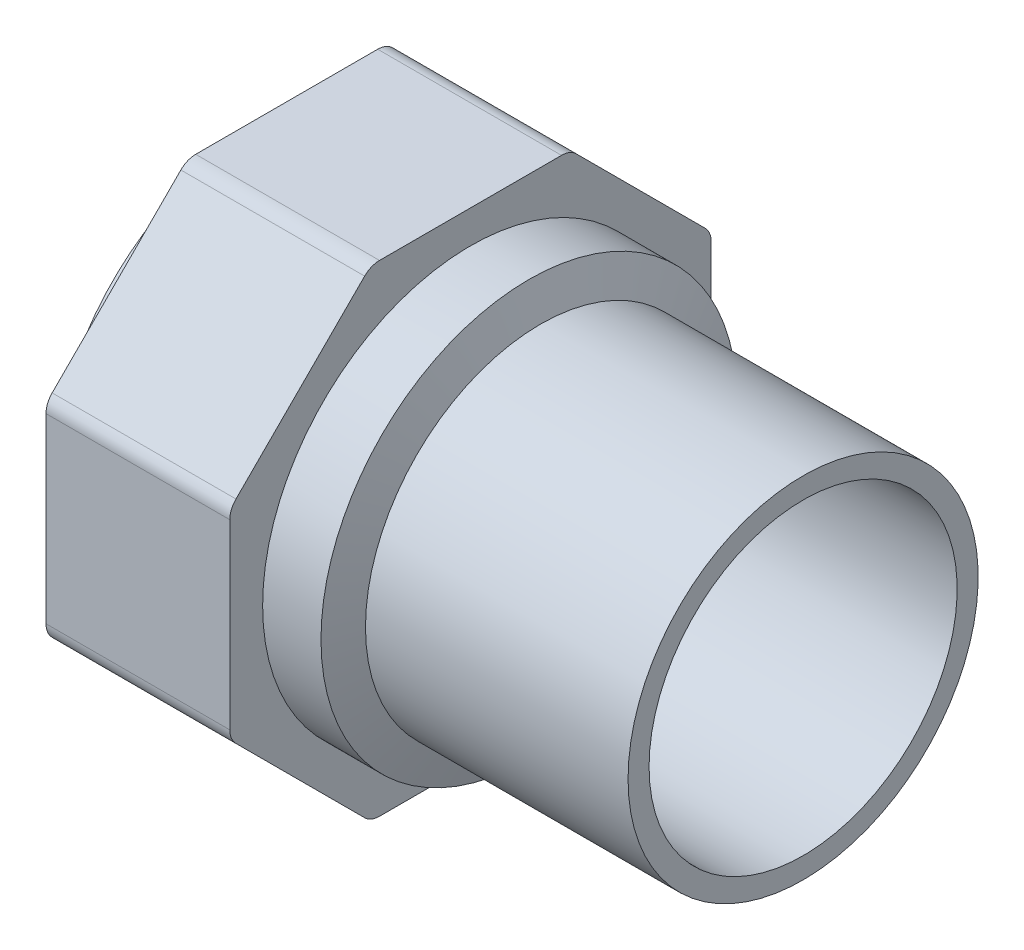
ISO-10303-21;
HEADER;
FILE_DESCRIPTION(('STEP AP214'),'2;1');
FILE_NAME('part.step','',(''),(''),'','','');
FILE_SCHEMA(('AUTOMOTIVE_DESIGN { 1 0 10303 214 1 1 1 1 }'));
ENDSEC;
DATA;
#1=APPLICATION_CONTEXT('core data for automotive mechanical design processes');
#2=APPLICATION_PROTOCOL_DEFINITION('international standard','automotive_design',2000,#1);
#3=PRODUCT_CONTEXT('',#1,'mechanical');
#4=PRODUCT('Part','Part','',(#3));
#5=PRODUCT_RELATED_PRODUCT_CATEGORY('part','',(#4));
#6=PRODUCT_DEFINITION_FORMATION('','',#4);
#7=PRODUCT_DEFINITION_CONTEXT('part definition',#1,'design');
#8=PRODUCT_DEFINITION('design','',#6,#7);
#9=PRODUCT_DEFINITION_SHAPE('','',#8);
#10=(LENGTH_UNIT() NAMED_UNIT(*) SI_UNIT(.MILLI.,.METRE.));
#11=(NAMED_UNIT(*) PLANE_ANGLE_UNIT() SI_UNIT($,.RADIAN.));
#12=(NAMED_UNIT(*) SI_UNIT($,.STERADIAN.) SOLID_ANGLE_UNIT());
#13=UNCERTAINTY_MEASURE_WITH_UNIT(LENGTH_MEASURE(1.E-05),#10,'distance_accuracy_value','');
#14=(GEOMETRIC_REPRESENTATION_CONTEXT(3) GLOBAL_UNCERTAINTY_ASSIGNED_CONTEXT((#13)) GLOBAL_UNIT_ASSIGNED_CONTEXT((#10,
#11,#12)) REPRESENTATION_CONTEXT('',''));
#15=CARTESIAN_POINT('',(0.,0.,0.));
#16=DIRECTION('',(0.,0.,1.));
#17=DIRECTION('',(1.,0.,0.));
#18=AXIS2_PLACEMENT_3D('',#15,#16,#17);
#19=CARTESIAN_POINT('',(-30.,0.,0.));
#20=DIRECTION('',(-1.,0.,0.));
#21=DIRECTION('',(0.,0.,1.));
#22=AXIS2_PLACEMENT_3D('',#19,#20,#21);
#23=CYLINDRICAL_SURFACE('',#22,20.);
#24=CARTESIAN_POINT('',(-30.,0.,0.));
#25=DIRECTION('',(1.,0.,0.));
#26=DIRECTION('',(0.,1.,0.));
#27=AXIS2_PLACEMENT_3D('',#24,#25,#26);
#28=CIRCLE('',#27,20.);
#29=CARTESIAN_POINT('',(-30.,20.,0.));
#30=VERTEX_POINT('',#29);
#31=EDGE_CURVE('E193',#30,#30,#28,.F.);
#32=ORIENTED_EDGE('',*,*,#31,.F.);
#33=EDGE_LOOP('',(#32));
#34=FACE_BOUND('',#33,.T.);
#35=CARTESIAN_POINT('',(0.,0.,0.));
#36=DIRECTION('',(-1.,0.,0.));
#37=DIRECTION('',(0.,0.,1.));
#38=AXIS2_PLACEMENT_3D('',#35,#36,#37);
#39=CIRCLE('',#38,20.);
#40=CARTESIAN_POINT('',(0.,0.,20.));
#41=VERTEX_POINT('',#40);
#42=EDGE_CURVE('E18',#41,#41,#39,.F.);
#43=ORIENTED_EDGE('',*,*,#42,.F.);
#44=EDGE_LOOP('',(#43));
#45=FACE_BOUND('',#44,.T.);
#46=ADVANCED_FACE('F15',(#34,#45),#23,.T.);
#47=CARTESIAN_POINT('',(-30.,0.,0.));
#48=DIRECTION('',(-1.,0.,0.));
#49=DIRECTION('',(0.,0.,1.));
#50=AXIS2_PLACEMENT_3D('',#47,#48,#49);
#51=CONICAL_SURFACE('',#50,20.,1.22918083614709);
#52=CARTESIAN_POINT('',(-31.3333333333333,0.,0.));
#53=DIRECTION('',(-1.,0.,0.));
#54=DIRECTION('',(0.,1.,0.));
#55=AXIS2_PLACEMENT_3D('',#52,#53,#54);
#56=CIRCLE('',#55,23.75);
#57=CARTESIAN_POINT('',(-31.3333333333333,23.75,0.));
#58=VERTEX_POINT('',#57);
#59=EDGE_CURVE('E189',#58,#58,#56,.T.);
#60=ORIENTED_EDGE('',*,*,#59,.F.);
#61=EDGE_LOOP('',(#60));
#62=FACE_BOUND('',#61,.T.);
#63=ORIENTED_EDGE('',*,*,#31,.T.);
#64=EDGE_LOOP('',(#63));
#65=FACE_BOUND('',#64,.T.);
#66=ADVANCED_FACE('F268',(#62,#65),#51,.T.);
#67=CARTESIAN_POINT('',(0.,20.,20.2400021083974));
#68=DIRECTION('',(1.,0.,0.));
#69=DIRECTION('',(0.,-1.,0.));
#70=AXIS2_PLACEMENT_3D('',#67,#68,#69);
#71=PLANE('',#70);
#72=CARTESIAN_POINT('',(0.,0.,0.));
#73=DIRECTION('',(-1.,0.,0.));
#74=DIRECTION('',(0.,0.,1.));
#75=AXIS2_PLACEMENT_3D('',#72,#73,#74);
#76=CIRCLE('',#75,17.6);
#77=CARTESIAN_POINT('',(0.,0.,17.6));
#78=VERTEX_POINT('',#77);
#79=EDGE_CURVE('E192',#78,#78,#76,.F.);
#80=ORIENTED_EDGE('',*,*,#79,.F.);
#81=EDGE_LOOP('',(#80));
#82=FACE_BOUND('',#81,.T.);
#83=ORIENTED_EDGE('',*,*,#42,.T.);
#84=EDGE_LOOP('',(#83));
#85=FACE_BOUND('',#84,.T.);
#86=ADVANCED_FACE('F264',(#82,#85),#71,.T.);
#87=CARTESIAN_POINT('',(-38.,0.,0.));
#88=DIRECTION('',(-1.,0.,0.));
#89=DIRECTION('',(0.,0.,1.));
#90=AXIS2_PLACEMENT_3D('',#87,#88,#89);
#91=CYLINDRICAL_SURFACE('',#90,23.75);
#92=CARTESIAN_POINT('',(-38.,0.,0.));
#93=DIRECTION('',(-1.,0.,0.));
#94=DIRECTION('',(0.,0.,1.));
#95=AXIS2_PLACEMENT_3D('',#92,#93,#94);
#96=CIRCLE('',#95,23.75);
#97=CARTESIAN_POINT('',(-38.,0.,23.75));
#98=VERTEX_POINT('',#97);
#99=EDGE_CURVE('E188',#98,#98,#96,.T.);
#100=ORIENTED_EDGE('',*,*,#99,.F.);
#101=EDGE_LOOP('',(#100));
#102=FACE_BOUND('',#101,.T.);
#103=ORIENTED_EDGE('',*,*,#59,.T.);
#104=EDGE_LOOP('',(#103));
#105=FACE_BOUND('',#104,.T.);
#106=ADVANCED_FACE('F267',(#102,#105),#91,.T.);
#107=CARTESIAN_POINT('',(0.,0.,0.));
#108=DIRECTION('',(-1.,0.,0.));
#109=DIRECTION('',(0.,0.,1.));
#110=AXIS2_PLACEMENT_3D('',#107,#108,#109);
#111=CYLINDRICAL_SURFACE('',#110,17.6);
#112=ORIENTED_EDGE('',*,*,#79,.T.);
#113=EDGE_LOOP('',(#112));
#114=FACE_BOUND('',#113,.T.);
#115=CARTESIAN_POINT('',(-37.6326404910334,0.,0.));
#116=DIRECTION('',(1.,0.,0.));
#117=DIRECTION('',(0.,1.,0.));
#118=AXIS2_PLACEMENT_3D('',#115,#116,#117);
#119=CIRCLE('',#118,17.6);
#120=CARTESIAN_POINT('',(-37.6326404910334,17.6,0.));
#121=VERTEX_POINT('',#120);
#122=EDGE_CURVE('E135',#121,#121,#119,.T.);
#123=ORIENTED_EDGE('',*,*,#122,.F.);
#124=EDGE_LOOP('',(#123));
#125=FACE_BOUND('',#124,.T.);
#126=ADVANCED_FACE('F261',(#114,#125),#111,.F.);
#127=CARTESIAN_POINT('',(-38.,27.5,27.5));
#128=DIRECTION('',(1.,0.,0.));
#129=DIRECTION('',(0.,-1.,0.));
#130=AXIS2_PLACEMENT_3D('',#127,#128,#129);
#131=PLANE('',#130);
#132=ORIENTED_EDGE('',*,*,#99,.T.);
#133=EDGE_LOOP('',(#132));
#134=FACE_BOUND('',#133,.T.);
#135=CARTESIAN_POINT('',(-38.,10.3967604155647,25.1));
#136=DIRECTION('',(1.,0.,0.));
#137=DIRECTION('',(0.,0.,-1.));
#138=AXIS2_PLACEMENT_3D('',#135,#136,#137);
#139=CIRCLE('',#138,2.4);
#140=CARTESIAN_POINT('',(-38.,10.3967604155647,27.5));
#141=VERTEX_POINT('',#140);
#142=CARTESIAN_POINT('',(-38.,12.0938166904124,26.7970562748477));
#143=VERTEX_POINT('',#142);
#144=EDGE_CURVE('E254',#141,#143,#139,.F.);
#145=ORIENTED_EDGE('',*,*,#144,.F.);
#146=DIRECTION('',(0.,1.,0.));
#147=VECTOR('',#146,1.);
#148=CARTESIAN_POINT('',(-38.,0.,27.5));
#149=LINE('',#148,#147);
#150=CARTESIAN_POINT('',(-38.,-10.3967604155647,27.5));
#151=VERTEX_POINT('',#150);
#152=EDGE_CURVE('E132',#151,#141,#149,.T.);
#153=ORIENTED_EDGE('',*,*,#152,.F.);
#154=CARTESIAN_POINT('',(-38.,-10.3967604155647,25.1));
#155=DIRECTION('',(1.,0.,0.));
#156=DIRECTION('',(0.,0.,-1.));
#157=AXIS2_PLACEMENT_3D('',#154,#155,#156);
#158=CIRCLE('',#157,2.39999999999996);
#159=CARTESIAN_POINT('',(-38.,-12.0938166904124,26.7970562748477));
#160=VERTEX_POINT('',#159);
#161=EDGE_CURVE('E126',#160,#151,#158,.F.);
#162=ORIENTED_EDGE('',*,*,#161,.F.);
#163=DIRECTION('',(0.,0.707106781186547,0.707106781186548));
#164=VECTOR('',#163,1.);
#165=CARTESIAN_POINT('',(-38.,-19.4454364826301,19.44543648263));
#166=LINE('',#165,#164);
#167=CARTESIAN_POINT('',(-38.,-26.7970562748477,12.0938166904124));
#168=VERTEX_POINT('',#167);
#169=EDGE_CURVE('E130',#168,#160,#166,.T.);
#170=ORIENTED_EDGE('',*,*,#169,.F.);
#171=CARTESIAN_POINT('',(-38.,-25.1,10.3967604155647));
#172=DIRECTION('',(1.,0.,0.));
#173=DIRECTION('',(0.,0.,-1.));
#174=AXIS2_PLACEMENT_3D('',#171,#172,#173);
#175=CIRCLE('',#174,2.39999999999998);
#176=CARTESIAN_POINT('',(-38.,-27.5,10.3967604155647));
#177=VERTEX_POINT('',#176);
#178=EDGE_CURVE('E149',#177,#168,#175,.F.);
#179=ORIENTED_EDGE('',*,*,#178,.F.);
#180=DIRECTION('',(0.,0.,1.));
#181=VECTOR('',#180,1.);
#182=CARTESIAN_POINT('',(-38.,-27.5,0.));
#183=LINE('',#182,#181);
#184=CARTESIAN_POINT('',(-38.,-27.5,-10.3967604155647));
#185=VERTEX_POINT('',#184);
#186=EDGE_CURVE('E154',#185,#177,#183,.T.);
#187=ORIENTED_EDGE('',*,*,#186,.F.);
#188=CARTESIAN_POINT('',(-38.,-25.1,-10.3967604155647));
#189=DIRECTION('',(1.,0.,0.));
#190=DIRECTION('',(0.,0.,-1.));
#191=AXIS2_PLACEMENT_3D('',#188,#189,#190);
#192=CIRCLE('',#191,2.39999999999995);
#193=CARTESIAN_POINT('',(-38.,-26.7970562748477,-12.0938166904124));
#194=VERTEX_POINT('',#193);
#195=EDGE_CURVE('E239',#194,#185,#192,.F.);
#196=ORIENTED_EDGE('',*,*,#195,.F.);
#197=DIRECTION('',(0.,-0.707106781186548,0.707106781186547));
#198=VECTOR('',#197,1.);
#199=CARTESIAN_POINT('',(-38.,-19.44543648263,-19.4454364826301));
#200=LINE('',#199,#198);
#201=CARTESIAN_POINT('',(-38.,-12.0938166904124,-26.7970562748477));
#202=VERTEX_POINT('',#201);
#203=EDGE_CURVE('E159',#202,#194,#200,.T.);
#204=ORIENTED_EDGE('',*,*,#203,.F.);
#205=CARTESIAN_POINT('',(-38.,-10.3967604155647,-25.1));
#206=DIRECTION('',(1.,0.,0.));
#207=DIRECTION('',(0.,0.,-1.));
#208=AXIS2_PLACEMENT_3D('',#205,#206,#207);
#209=CIRCLE('',#208,2.39999999999997);
#210=CARTESIAN_POINT('',(-38.,-10.3967604155647,-27.5));
#211=VERTEX_POINT('',#210);
#212=EDGE_CURVE('E242',#211,#202,#209,.F.);
#213=ORIENTED_EDGE('',*,*,#212,.F.);
#214=DIRECTION('',(0.,-1.,0.));
#215=VECTOR('',#214,1.);
#216=CARTESIAN_POINT('',(-38.,0.,-27.5));
#217=LINE('',#216,#215);
#218=CARTESIAN_POINT('',(-38.,10.3967604155647,-27.5));
#219=VERTEX_POINT('',#218);
#220=EDGE_CURVE('E164',#219,#211,#217,.T.);
#221=ORIENTED_EDGE('',*,*,#220,.F.);
#222=CARTESIAN_POINT('',(-38.,10.3967604155647,-25.1));
#223=DIRECTION('',(1.,0.,0.));
#224=DIRECTION('',(0.,0.,-1.));
#225=AXIS2_PLACEMENT_3D('',#222,#223,#224);
#226=CIRCLE('',#225,2.39999999999999);
#227=CARTESIAN_POINT('',(-38.,12.0938166904124,-26.7970562748477));
#228=VERTEX_POINT('',#227);
#229=EDGE_CURVE('E245',#228,#219,#226,.F.);
#230=ORIENTED_EDGE('',*,*,#229,.F.);
#231=DIRECTION('',(0.,-0.707106781186548,-0.707106781186547));
#232=VECTOR('',#231,1.);
#233=CARTESIAN_POINT('',(-38.,19.4454364826301,-19.4454364826301));
#234=LINE('',#233,#232);
#235=CARTESIAN_POINT('',(-38.,26.7970562748477,-12.0938166904124));
#236=VERTEX_POINT('',#235);
#237=EDGE_CURVE('E169',#236,#228,#234,.T.);
#238=ORIENTED_EDGE('',*,*,#237,.F.);
#239=CARTESIAN_POINT('',(-38.,25.1,-10.3967604155647));
#240=DIRECTION('',(1.,0.,0.));
#241=DIRECTION('',(0.,0.,-1.));
#242=AXIS2_PLACEMENT_3D('',#239,#240,#241);
#243=CIRCLE('',#242,2.39999999999999);
#244=CARTESIAN_POINT('',(-38.,27.5,-10.3967604155647));
#245=VERTEX_POINT('',#244);
#246=EDGE_CURVE('E248',#245,#236,#243,.F.);
#247=ORIENTED_EDGE('',*,*,#246,.F.);
#248=DIRECTION('',(0.,0.,-1.));
#249=VECTOR('',#248,1.);
#250=CARTESIAN_POINT('',(-38.,27.5,0.));
#251=LINE('',#250,#249);
#252=CARTESIAN_POINT('',(-38.,27.5,10.3967604155647));
#253=VERTEX_POINT('',#252);
#254=EDGE_CURVE('E174',#253,#245,#251,.T.);
#255=ORIENTED_EDGE('',*,*,#254,.F.);
#256=CARTESIAN_POINT('',(-38.,25.1,10.3967604155647));
#257=DIRECTION('',(1.,0.,0.));
#258=DIRECTION('',(0.,0.,-1.));
#259=AXIS2_PLACEMENT_3D('',#256,#257,#258);
#260=CIRCLE('',#259,2.39999999999998);
#261=CARTESIAN_POINT('',(-38.,26.7970562748477,12.0938166904124));
#262=VERTEX_POINT('',#261);
#263=EDGE_CURVE('E251',#262,#253,#260,.F.);
#264=ORIENTED_EDGE('',*,*,#263,.F.);
#265=DIRECTION('',(0.,0.707106781186548,-0.707106781186548));
#266=VECTOR('',#265,1.);
#267=CARTESIAN_POINT('',(-38.,19.4454364826301,19.4454364826301));
#268=LINE('',#267,#266);
#269=EDGE_CURVE('E179',#143,#262,#268,.T.);
#270=ORIENTED_EDGE('',*,*,#269,.F.);
#271=EDGE_LOOP('',(#145,#153,#162,#170,#179,#187,#196,#204,#213,#221,#230,#238,#247,#255,#264,#270));
#272=FACE_BOUND('',#271,.T.);
#273=ADVANCED_FACE('F128',(#134,#272),#131,.T.);
#274=CARTESIAN_POINT('',(-38.,0.,0.));
#275=DIRECTION('',(-1.,0.,0.));
#276=DIRECTION('',(0.,0.,1.));
#277=AXIS2_PLACEMENT_3D('',#274,#275,#276);
#278=CONICAL_SURFACE('',#277,18.2362853341737,1.04719755119659);
#279=ORIENTED_EDGE('',*,*,#122,.T.);
#280=EDGE_LOOP('',(#279));
#281=FACE_BOUND('',#280,.T.);
#282=CARTESIAN_POINT('',(-38.,0.,0.));
#283=DIRECTION('',(1.,0.,0.));
#284=DIRECTION('',(0.,1.,0.));
#285=AXIS2_PLACEMENT_3D('',#282,#283,#284);
#286=CIRCLE('',#285,18.2362853341737);
#287=CARTESIAN_POINT('',(-38.,18.2362853341737,0.));
#288=VERTEX_POINT('',#287);
#289=EDGE_CURVE('E153',#288,#288,#286,.T.);
#290=ORIENTED_EDGE('',*,*,#289,.F.);
#291=EDGE_LOOP('',(#290));
#292=FACE_BOUND('',#291,.T.);
#293=ADVANCED_FACE('F438',(#281,#292),#278,.F.);
#294=CARTESIAN_POINT('',(-38.,-10.3967604155647,25.1));
#295=DIRECTION('',(1.,0.,0.));
#296=DIRECTION('',(0.,0.,-1.));
#297=AXIS2_PLACEMENT_3D('',#294,#295,#296);
#298=CYLINDRICAL_SURFACE('',#297,2.39999999999996);
#299=CARTESIAN_POINT('',(-59.,-10.3967604155647,25.1));
#300=DIRECTION('',(1.,0.,0.));
#301=DIRECTION('',(0.,0.,-1.));
#302=AXIS2_PLACEMENT_3D('',#299,#300,#301);
#303=CIRCLE('',#302,2.39999999999996);
#304=CARTESIAN_POINT('',(-59.,-12.0938166904124,26.7970562748477));
#305=VERTEX_POINT('',#304);
#306=CARTESIAN_POINT('',(-59.,-10.3967604155647,27.5));
#307=VERTEX_POINT('',#306);
#308=EDGE_CURVE('E141',#305,#307,#303,.F.);
#309=ORIENTED_EDGE('',*,*,#308,.F.);
#310=DIRECTION('',(1.,0.,0.));
#311=VECTOR('',#310,1.);
#312=CARTESIAN_POINT('',(-59.,-12.0938166904124,26.7970562748477));
#313=LINE('',#312,#311);
#314=EDGE_CURVE('E138',#160,#305,#313,.F.);
#315=ORIENTED_EDGE('',*,*,#314,.F.);
#316=ORIENTED_EDGE('',*,*,#161,.T.);
#317=DIRECTION('',(1.,0.,0.));
#318=VECTOR('',#317,1.);
#319=CARTESIAN_POINT('',(-59.,-10.3967604155647,27.5));
#320=LINE('',#319,#318);
#321=EDGE_CURVE('E185',#307,#151,#320,.T.);
#322=ORIENTED_EDGE('',*,*,#321,.F.);
#323=EDGE_LOOP('',(#309,#315,#316,#322));
#324=FACE_BOUND('',#323,.T.);
#325=ADVANCED_FACE('F139',(#324),#298,.T.);
#326=CARTESIAN_POINT('',(-59.,10.3967604155647,27.5));
#327=DIRECTION('',(0.,0.,1.));
#328=DIRECTION('',(0.,-1.,0.));
#329=AXIS2_PLACEMENT_3D('',#326,#327,#328);
#330=PLANE('',#329);
#331=DIRECTION('',(0.,1.,0.));
#332=VECTOR('',#331,1.);
#333=CARTESIAN_POINT('',(-59.,0.,27.5));
#334=LINE('',#333,#332);
#335=CARTESIAN_POINT('',(-59.,10.3967604155647,27.5));
#336=VERTEX_POINT('',#335);
#337=EDGE_CURVE('E236',#307,#336,#334,.T.);
#338=ORIENTED_EDGE('',*,*,#337,.F.);
#339=ORIENTED_EDGE('',*,*,#321,.T.);
#340=ORIENTED_EDGE('',*,*,#152,.T.);
#341=DIRECTION('',(1.,0.,0.));
#342=VECTOR('',#341,1.);
#343=CARTESIAN_POINT('',(-48.5,10.3967604155647,27.5));
#344=LINE('',#343,#342);
#345=EDGE_CURVE('E183',#336,#141,#344,.T.);
#346=ORIENTED_EDGE('',*,*,#345,.F.);
#347=EDGE_LOOP('',(#338,#339,#340,#346));
#348=FACE_BOUND('',#347,.T.);
#349=ADVANCED_FACE('F387',(#348),#330,.T.);
#350=CARTESIAN_POINT('',(-38.,10.3967604155647,25.1));
#351=DIRECTION('',(1.,0.,0.));
#352=DIRECTION('',(0.,0.,-1.));
#353=AXIS2_PLACEMENT_3D('',#350,#351,#352);
#354=CYLINDRICAL_SURFACE('',#353,2.4);
#355=CARTESIAN_POINT('',(-59.,10.3967604155647,25.1));
#356=DIRECTION('',(1.,0.,0.));
#357=DIRECTION('',(0.,0.,-1.));
#358=AXIS2_PLACEMENT_3D('',#355,#356,#357);
#359=CIRCLE('',#358,2.4);
#360=CARTESIAN_POINT('',(-59.,12.0938166904124,26.7970562748477));
#361=VERTEX_POINT('',#360);
#362=EDGE_CURVE('E233',#336,#361,#359,.F.);
#363=ORIENTED_EDGE('',*,*,#362,.F.);
#364=ORIENTED_EDGE('',*,*,#345,.T.);
#365=ORIENTED_EDGE('',*,*,#144,.T.);
#366=DIRECTION('',(1.,0.,0.));
#367=VECTOR('',#366,1.);
#368=CARTESIAN_POINT('',(-59.,12.0938166904124,26.7970562748477));
#369=LINE('',#368,#367);
#370=EDGE_CURVE('E182',#361,#143,#369,.T.);
#371=ORIENTED_EDGE('',*,*,#370,.F.);
#372=EDGE_LOOP('',(#363,#364,#365,#371));
#373=FACE_BOUND('',#372,.T.);
#374=ADVANCED_FACE('F425',(#373),#354,.T.);
#375=CARTESIAN_POINT('',(-59.,26.7970562748477,12.0938166904124));
#376=DIRECTION('',(0.,0.707106781186547,0.707106781186547));
#377=DIRECTION('',(0.,-0.707106781186547,0.707106781186547));
#378=AXIS2_PLACEMENT_3D('',#375,#376,#377);
#379=PLANE('',#378);
#380=CARTESIAN_POINT('',(-59.,12.0938166904124,26.7970562748477));
#381=CARTESIAN_POINT('',(-59.,12.7064516730972,26.1844212921629));
#382=CARTESIAN_POINT('',(-59.,13.319086655782,25.5717863094781));
#383=CARTESIAN_POINT('',(-59.,14.5443566211516,24.3465163441085));
#384=CARTESIAN_POINT('',(-59.,15.1569916038364,23.7338813614237));
#385=CARTESIAN_POINT('',(-59.,16.382261569206,22.5086113960541));
#386=CARTESIAN_POINT('',(-59.,16.9948965518908,21.8959764133693));
#387=CARTESIAN_POINT('',(-59.,18.2201665172604,20.6707064479997));
#388=CARTESIAN_POINT('',(-59.,18.8328014999453,20.0580714653149));
#389=CARTESIAN_POINT('',(-59.,20.0580714653149,18.8328014999453));
#390=CARTESIAN_POINT('',(-59.,20.6707064479997,18.2201665172604));
#391=CARTESIAN_POINT('',(-59.,21.8959764133693,16.9948965518908));
#392=CARTESIAN_POINT('',(-59.,22.5086113960541,16.382261569206));
#393=CARTESIAN_POINT('',(-59.,23.7338813614237,15.1569916038364));
#394=CARTESIAN_POINT('',(-59.,24.3465163441085,14.5443566211516));
#395=CARTESIAN_POINT('',(-59.,25.5717863094781,13.319086655782));
#396=CARTESIAN_POINT('',(-59.,26.1844212921629,12.7064516730972));
#397=CARTESIAN_POINT('',(-59.,26.7970562748477,12.0938166904124));
#398=B_SPLINE_CURVE_WITH_KNOTS('',3,(#380,#381,#382,#383,#384,#385,#386,#387,#388,#389,#390,
#391,#392,#393,#394,#395,#396,#397),.UNSPECIFIED.,.F.,.F.,(4,2,2,2,2,2,2,2,4),(0.,
2.59919010389117,5.19838020778234,7.79757031167351,10.3967604155647,12.9959505194559,
15.595140623347,18.1943307272382,20.7935208311294),.UNSPECIFIED.);
#399=CARTESIAN_POINT('',(-59.,26.7970562748477,12.0938166904124));
#400=VERTEX_POINT('',#399);
#401=EDGE_CURVE('E232',#361,#400,#398,.T.);
#402=ORIENTED_EDGE('',*,*,#401,.F.);
#403=ORIENTED_EDGE('',*,*,#370,.T.);
#404=ORIENTED_EDGE('',*,*,#269,.T.);
#405=DIRECTION('',(1.,0.,0.));
#406=VECTOR('',#405,1.);
#407=CARTESIAN_POINT('',(-48.5,26.7970562748477,12.0938166904124));
#408=LINE('',#407,#406);
#409=EDGE_CURVE('E178',#400,#262,#408,.T.);
#410=ORIENTED_EDGE('',*,*,#409,.F.);
#411=EDGE_LOOP('',(#402,#403,#404,#410));
#412=FACE_BOUND('',#411,.T.);
#413=ADVANCED_FACE('F423',(#412),#379,.T.);
#414=CARTESIAN_POINT('',(-38.,25.1,10.3967604155647));
#415=DIRECTION('',(1.,0.,0.));
#416=DIRECTION('',(0.,0.,-1.));
#417=AXIS2_PLACEMENT_3D('',#414,#415,#416);
#418=CYLINDRICAL_SURFACE('',#417,2.39999999999998);
#419=CARTESIAN_POINT('',(-59.,25.1,10.3967604155647));
#420=DIRECTION('',(1.,0.,0.));
#421=DIRECTION('',(0.,0.,-1.));
#422=AXIS2_PLACEMENT_3D('',#419,#420,#421);
#423=CIRCLE('',#422,2.39999999999998);
#424=CARTESIAN_POINT('',(-59.,27.5,10.3967604155647));
#425=VERTEX_POINT('',#424);
#426=EDGE_CURVE('E229',#400,#425,#423,.F.);
#427=ORIENTED_EDGE('',*,*,#426,.F.);
#428=ORIENTED_EDGE('',*,*,#409,.T.);
#429=ORIENTED_EDGE('',*,*,#263,.T.);
#430=DIRECTION('',(1.,0.,0.));
#431=VECTOR('',#430,1.);
#432=CARTESIAN_POINT('',(-59.,27.5,10.3967604155647));
#433=LINE('',#432,#431);
#434=EDGE_CURVE('E177',#425,#253,#433,.T.);
#435=ORIENTED_EDGE('',*,*,#434,.F.);
#436=EDGE_LOOP('',(#427,#428,#429,#435));
#437=FACE_BOUND('',#436,.T.);
#438=ADVANCED_FACE('F420',(#437),#418,.T.);
#439=CARTESIAN_POINT('',(-59.,27.5,-10.3967604155647));
#440=DIRECTION('',(0.,1.,0.));
#441=DIRECTION('',(0.,0.,1.));
#442=AXIS2_PLACEMENT_3D('',#439,#440,#441);
#443=PLANE('',#442);
#444=DIRECTION('',(0.,0.,-1.));
#445=VECTOR('',#444,1.);
#446=CARTESIAN_POINT('',(-59.,27.5,27.5));
#447=LINE('',#446,#445);
#448=CARTESIAN_POINT('',(-59.,27.5,-10.3967604155647));
#449=VERTEX_POINT('',#448);
#450=EDGE_CURVE('E228',#425,#449,#447,.T.);
#451=ORIENTED_EDGE('',*,*,#450,.F.);
#452=ORIENTED_EDGE('',*,*,#434,.T.);
#453=ORIENTED_EDGE('',*,*,#254,.T.);
#454=DIRECTION('',(1.,0.,0.));
#455=VECTOR('',#454,1.);
#456=CARTESIAN_POINT('',(-48.5,27.5,-10.3967604155647));
#457=LINE('',#456,#455);
#458=EDGE_CURVE('E173',#449,#245,#457,.T.);
#459=ORIENTED_EDGE('',*,*,#458,.F.);
#460=EDGE_LOOP('',(#451,#452,#453,#459));
#461=FACE_BOUND('',#460,.T.);
#462=ADVANCED_FACE('F417',(#461),#443,.T.);
#463=CARTESIAN_POINT('',(-38.,25.1,-10.3967604155647));
#464=DIRECTION('',(1.,0.,0.));
#465=DIRECTION('',(0.,0.,-1.));
#466=AXIS2_PLACEMENT_3D('',#463,#464,#465);
#467=CYLINDRICAL_SURFACE('',#466,2.39999999999999);
#468=CARTESIAN_POINT('',(-59.,25.1,-10.3967604155647));
#469=DIRECTION('',(1.,0.,0.));
#470=DIRECTION('',(0.,0.,-1.));
#471=AXIS2_PLACEMENT_3D('',#468,#469,#470);
#472=CIRCLE('',#471,2.39999999999999);
#473=CARTESIAN_POINT('',(-59.,26.7970562748477,-12.0938166904124));
#474=VERTEX_POINT('',#473);
#475=EDGE_CURVE('E225',#449,#474,#472,.F.);
#476=ORIENTED_EDGE('',*,*,#475,.F.);
#477=ORIENTED_EDGE('',*,*,#458,.T.);
#478=ORIENTED_EDGE('',*,*,#246,.T.);
#479=DIRECTION('',(1.,0.,0.));
#480=VECTOR('',#479,1.);
#481=CARTESIAN_POINT('',(-59.,26.7970562748477,-12.0938166904124));
#482=LINE('',#481,#480);
#483=EDGE_CURVE('E172',#474,#236,#482,.T.);
#484=ORIENTED_EDGE('',*,*,#483,.F.);
#485=EDGE_LOOP('',(#476,#477,#478,#484));
#486=FACE_BOUND('',#485,.T.);
#487=ADVANCED_FACE('F414',(#486),#467,.T.);
#488=CARTESIAN_POINT('',(-59.,12.0938166904124,-26.7970562748477));
#489=DIRECTION('',(0.,0.707106781186547,-0.707106781186547));
#490=DIRECTION('',(0.,0.707106781186547,0.707106781186547));
#491=AXIS2_PLACEMENT_3D('',#488,#489,#490);
#492=PLANE('',#491);
#493=CARTESIAN_POINT('',(-59.,26.7970562748477,-12.0938166904124));
#494=CARTESIAN_POINT('',(-59.,26.1844212921629,-12.7064516730972));
#495=CARTESIAN_POINT('',(-59.,25.5717863094781,-13.319086655782));
#496=CARTESIAN_POINT('',(-59.,24.3465163441085,-14.5443566211516));
#497=CARTESIAN_POINT('',(-59.,23.7338813614237,-15.1569916038364));
#498=CARTESIAN_POINT('',(-59.,22.5086113960541,-16.382261569206));
#499=CARTESIAN_POINT('',(-59.,21.8959764133693,-16.9948965518908));
#500=CARTESIAN_POINT('',(-59.,20.6707064479997,-18.2201665172604));
#501=CARTESIAN_POINT('',(-59.,20.0580714653149,-18.8328014999452));
#502=CARTESIAN_POINT('',(-59.,18.8328014999453,-20.0580714653149));
#503=CARTESIAN_POINT('',(-59.,18.2201665172605,-20.6707064479997));
#504=CARTESIAN_POINT('',(-59.,16.9948965518909,-21.8959764133693));
#505=CARTESIAN_POINT('',(-59.,16.382261569206,-22.5086113960541));
#506=CARTESIAN_POINT('',(-59.,15.1569916038364,-23.7338813614237));
#507=CARTESIAN_POINT('',(-59.,14.5443566211516,-24.3465163441085));
#508=CARTESIAN_POINT('',(-59.,13.319086655782,-25.5717863094781));
#509=CARTESIAN_POINT('',(-59.,12.7064516730972,-26.1844212921629));
#510=CARTESIAN_POINT('',(-59.,12.0938166904124,-26.7970562748477));
#511=B_SPLINE_CURVE_WITH_KNOTS('',3,(#493,#494,#495,#496,#497,#498,#499,#500,#501,#502,#503,
#504,#505,#506,#507,#508,#509,#510),.UNSPECIFIED.,.F.,.F.,(4,2,2,2,2,2,2,2,4),(0.,
2.59919010389117,5.19838020778234,7.79757031167351,10.3967604155647,12.9959505194559,
15.595140623347,18.1943307272382,20.7935208311294),.UNSPECIFIED.);
#512=CARTESIAN_POINT('',(-59.,12.0938166904124,-26.7970562748477));
#513=VERTEX_POINT('',#512);
#514=EDGE_CURVE('E224',#474,#513,#511,.T.);
#515=ORIENTED_EDGE('',*,*,#514,.F.);
#516=ORIENTED_EDGE('',*,*,#483,.T.);
#517=ORIENTED_EDGE('',*,*,#237,.T.);
#518=DIRECTION('',(1.,0.,0.));
#519=VECTOR('',#518,1.);
#520=CARTESIAN_POINT('',(-48.5,12.0938166904124,-26.7970562748477));
#521=LINE('',#520,#519);
#522=EDGE_CURVE('E168',#513,#228,#521,.T.);
#523=ORIENTED_EDGE('',*,*,#522,.F.);
#524=EDGE_LOOP('',(#515,#516,#517,#523));
#525=FACE_BOUND('',#524,.T.);
#526=ADVANCED_FACE('F411',(#525),#492,.T.);
#527=CARTESIAN_POINT('',(-38.,10.3967604155647,-25.1));
#528=DIRECTION('',(1.,0.,0.));
#529=DIRECTION('',(0.,0.,-1.));
#530=AXIS2_PLACEMENT_3D('',#527,#528,#529);
#531=CYLINDRICAL_SURFACE('',#530,2.39999999999999);
#532=CARTESIAN_POINT('',(-59.,10.3967604155647,-25.1));
#533=DIRECTION('',(1.,0.,0.));
#534=DIRECTION('',(0.,0.,-1.));
#535=AXIS2_PLACEMENT_3D('',#532,#533,#534);
#536=CIRCLE('',#535,2.39999999999999);
#537=CARTESIAN_POINT('',(-59.,10.3967604155647,-27.5));
#538=VERTEX_POINT('',#537);
#539=EDGE_CURVE('E221',#513,#538,#536,.F.);
#540=ORIENTED_EDGE('',*,*,#539,.F.);
#541=ORIENTED_EDGE('',*,*,#522,.T.);
#542=ORIENTED_EDGE('',*,*,#229,.T.);
#543=DIRECTION('',(1.,0.,0.));
#544=VECTOR('',#543,1.);
#545=CARTESIAN_POINT('',(-59.,10.3967604155647,-27.5));
#546=LINE('',#545,#544);
#547=EDGE_CURVE('E167',#538,#219,#546,.T.);
#548=ORIENTED_EDGE('',*,*,#547,.F.);
#549=EDGE_LOOP('',(#540,#541,#542,#548));
#550=FACE_BOUND('',#549,.T.);
#551=ADVANCED_FACE('F408',(#550),#531,.T.);
#552=CARTESIAN_POINT('',(-59.,-10.3967604155647,-27.5));
#553=DIRECTION('',(0.,0.,-1.));
#554=DIRECTION('',(0.,1.,0.));
#555=AXIS2_PLACEMENT_3D('',#552,#553,#554);
#556=PLANE('',#555);
#557=DIRECTION('',(0.,-1.,0.));
#558=VECTOR('',#557,1.);
#559=CARTESIAN_POINT('',(-59.,0.,-27.5));
#560=LINE('',#559,#558);
#561=CARTESIAN_POINT('',(-59.,-10.3967604155647,-27.5));
#562=VERTEX_POINT('',#561);
#563=EDGE_CURVE('E220',#538,#562,#560,.T.);
#564=ORIENTED_EDGE('',*,*,#563,.F.);
#565=ORIENTED_EDGE('',*,*,#547,.T.);
#566=ORIENTED_EDGE('',*,*,#220,.T.);
#567=DIRECTION('',(1.,0.,0.));
#568=VECTOR('',#567,1.);
#569=CARTESIAN_POINT('',(-48.5,-10.3967604155647,-27.5));
#570=LINE('',#569,#568);
#571=EDGE_CURVE('E163',#562,#211,#570,.T.);
#572=ORIENTED_EDGE('',*,*,#571,.F.);
#573=EDGE_LOOP('',(#564,#565,#566,#572));
#574=FACE_BOUND('',#573,.T.);
#575=ADVANCED_FACE('F405',(#574),#556,.T.);
#576=CARTESIAN_POINT('',(-38.,-10.3967604155647,-25.1));
#577=DIRECTION('',(1.,0.,0.));
#578=DIRECTION('',(0.,0.,-1.));
#579=AXIS2_PLACEMENT_3D('',#576,#577,#578);
#580=CYLINDRICAL_SURFACE('',#579,2.39999999999997);
#581=CARTESIAN_POINT('',(-59.,-10.3967604155647,-25.1));
#582=DIRECTION('',(1.,0.,0.));
#583=DIRECTION('',(0.,0.,-1.));
#584=AXIS2_PLACEMENT_3D('',#581,#582,#583);
#585=CIRCLE('',#584,2.39999999999997);
#586=CARTESIAN_POINT('',(-59.,-12.0938166904124,-26.7970562748477));
#587=VERTEX_POINT('',#586);
#588=EDGE_CURVE('E217',#562,#587,#585,.F.);
#589=ORIENTED_EDGE('',*,*,#588,.F.);
#590=ORIENTED_EDGE('',*,*,#571,.T.);
#591=ORIENTED_EDGE('',*,*,#212,.T.);
#592=DIRECTION('',(1.,0.,0.));
#593=VECTOR('',#592,1.);
#594=CARTESIAN_POINT('',(-59.,-12.0938166904124,-26.7970562748477));
#595=LINE('',#594,#593);
#596=EDGE_CURVE('E162',#587,#202,#595,.T.);
#597=ORIENTED_EDGE('',*,*,#596,.F.);
#598=EDGE_LOOP('',(#589,#590,#591,#597));
#599=FACE_BOUND('',#598,.T.);
#600=ADVANCED_FACE('F402',(#599),#580,.T.);
#601=CARTESIAN_POINT('',(-59.,-26.7970562748477,-12.0938166904124));
#602=DIRECTION('',(0.,-0.707106781186547,-0.707106781186548));
#603=DIRECTION('',(0.,0.707106781186548,-0.707106781186547));
#604=AXIS2_PLACEMENT_3D('',#601,#602,#603);
#605=PLANE('',#604);
#606=CARTESIAN_POINT('',(-59.,-12.0938166904124,-26.7970562748477));
#607=CARTESIAN_POINT('',(-59.,-12.7064516730972,-26.1844212921629));
#608=CARTESIAN_POINT('',(-59.,-13.319086655782,-25.5717863094781));
#609=CARTESIAN_POINT('',(-59.,-14.5443566211516,-24.3465163441085));
#610=CARTESIAN_POINT('',(-59.,-15.1569916038364,-23.7338813614237));
#611=CARTESIAN_POINT('',(-59.,-16.382261569206,-22.5086113960541));
#612=CARTESIAN_POINT('',(-59.,-16.9948965518908,-21.8959764133693));
#613=CARTESIAN_POINT('',(-59.,-18.2201665172604,-20.6707064479997));
#614=CARTESIAN_POINT('',(-59.,-18.8328014999452,-20.0580714653149));
#615=CARTESIAN_POINT('',(-59.,-20.0580714653149,-18.8328014999453));
#616=CARTESIAN_POINT('',(-59.,-20.6707064479997,-18.2201665172605));
#617=CARTESIAN_POINT('',(-59.,-21.8959764133693,-16.9948965518908));
#618=CARTESIAN_POINT('',(-59.,-22.5086113960541,-16.382261569206));
#619=CARTESIAN_POINT('',(-59.,-23.7338813614237,-15.1569916038364));
#620=CARTESIAN_POINT('',(-59.,-24.3465163441085,-14.5443566211516));
#621=CARTESIAN_POINT('',(-59.,-25.5717863094781,-13.319086655782));
#622=CARTESIAN_POINT('',(-59.,-26.1844212921629,-12.7064516730972));
#623=CARTESIAN_POINT('',(-59.,-26.7970562748477,-12.0938166904124));
#624=B_SPLINE_CURVE_WITH_KNOTS('',3,(#606,#607,#608,#609,#610,#611,#612,#613,#614,#615,#616,
#617,#618,#619,#620,#621,#622,#623),.UNSPECIFIED.,.F.,.F.,(4,2,2,2,2,2,2,2,4),(0.,
2.59919010389117,5.19838020778234,7.79757031167351,10.3967604155647,12.9959505194559,
15.595140623347,18.1943307272382,20.7935208311294),.UNSPECIFIED.);
#625=CARTESIAN_POINT('',(-59.,-26.7970562748477,-12.0938166904124));
#626=VERTEX_POINT('',#625);
#627=EDGE_CURVE('E216',#587,#626,#624,.T.);
#628=ORIENTED_EDGE('',*,*,#627,.F.);
#629=ORIENTED_EDGE('',*,*,#596,.T.);
#630=ORIENTED_EDGE('',*,*,#203,.T.);
#631=DIRECTION('',(1.,0.,0.));
#632=VECTOR('',#631,1.);
#633=CARTESIAN_POINT('',(-48.5,-26.7970562748477,-12.0938166904124));
#634=LINE('',#633,#632);
#635=EDGE_CURVE('E158',#626,#194,#634,.T.);
#636=ORIENTED_EDGE('',*,*,#635,.F.);
#637=EDGE_LOOP('',(#628,#629,#630,#636));
#638=FACE_BOUND('',#637,.T.);
#639=ADVANCED_FACE('F399',(#638),#605,.T.);
#640=CARTESIAN_POINT('',(-38.,-25.1,-10.3967604155647));
#641=DIRECTION('',(1.,0.,0.));
#642=DIRECTION('',(0.,0.,-1.));
#643=AXIS2_PLACEMENT_3D('',#640,#641,#642);
#644=CYLINDRICAL_SURFACE('',#643,2.39999999999995);
#645=CARTESIAN_POINT('',(-59.,-25.1,-10.3967604155647));
#646=DIRECTION('',(1.,0.,0.));
#647=DIRECTION('',(0.,0.,-1.));
#648=AXIS2_PLACEMENT_3D('',#645,#646,#647);
#649=CIRCLE('',#648,2.39999999999995);
#650=CARTESIAN_POINT('',(-59.,-27.5,-10.3967604155647));
#651=VERTEX_POINT('',#650);
#652=EDGE_CURVE('E213',#626,#651,#649,.F.);
#653=ORIENTED_EDGE('',*,*,#652,.F.);
#654=ORIENTED_EDGE('',*,*,#635,.T.);
#655=ORIENTED_EDGE('',*,*,#195,.T.);
#656=DIRECTION('',(1.,0.,0.));
#657=VECTOR('',#656,1.);
#658=CARTESIAN_POINT('',(-59.,-27.5,-10.3967604155647));
#659=LINE('',#658,#657);
#660=EDGE_CURVE('E157',#651,#185,#659,.T.);
#661=ORIENTED_EDGE('',*,*,#660,.F.);
#662=EDGE_LOOP('',(#653,#654,#655,#661));
#663=FACE_BOUND('',#662,.T.);
#664=ADVANCED_FACE('F396',(#663),#644,.T.);
#665=CARTESIAN_POINT('',(-59.,-27.5,10.3967604155647));
#666=DIRECTION('',(0.,-1.,0.));
#667=DIRECTION('',(0.,0.,-1.));
#668=AXIS2_PLACEMENT_3D('',#665,#666,#667);
#669=PLANE('',#668);
#670=DIRECTION('',(0.,0.,-1.));
#671=VECTOR('',#670,1.);
#672=CARTESIAN_POINT('',(-59.,-27.5,27.5));
#673=LINE('',#672,#671);
#674=CARTESIAN_POINT('',(-59.,-27.5,10.3967604155647));
#675=VERTEX_POINT('',#674);
#676=EDGE_CURVE('E212',#651,#675,#673,.F.);
#677=ORIENTED_EDGE('',*,*,#676,.F.);
#678=ORIENTED_EDGE('',*,*,#660,.T.);
#679=ORIENTED_EDGE('',*,*,#186,.T.);
#680=DIRECTION('',(1.,0.,0.));
#681=VECTOR('',#680,1.);
#682=CARTESIAN_POINT('',(-48.5,-27.5,10.3967604155647));
#683=LINE('',#682,#681);
#684=EDGE_CURVE('E146',#675,#177,#683,.T.);
#685=ORIENTED_EDGE('',*,*,#684,.F.);
#686=EDGE_LOOP('',(#677,#678,#679,#685));
#687=FACE_BOUND('',#686,.T.);
#688=ADVANCED_FACE('F393',(#687),#669,.T.);
#689=CARTESIAN_POINT('',(-38.,-25.1,10.3967604155647));
#690=DIRECTION('',(1.,0.,0.));
#691=DIRECTION('',(0.,0.,-1.));
#692=AXIS2_PLACEMENT_3D('',#689,#690,#691);
#693=CYLINDRICAL_SURFACE('',#692,2.39999999999998);
#694=CARTESIAN_POINT('',(-59.,-25.1,10.3967604155647));
#695=DIRECTION('',(1.,0.,0.));
#696=DIRECTION('',(0.,0.,-1.));
#697=AXIS2_PLACEMENT_3D('',#694,#695,#696);
#698=CIRCLE('',#697,2.39999999999998);
#699=CARTESIAN_POINT('',(-59.,-26.7970562748477,12.0938166904124));
#700=VERTEX_POINT('',#699);
#701=EDGE_CURVE('E208',#675,#700,#698,.F.);
#702=ORIENTED_EDGE('',*,*,#701,.F.);
#703=ORIENTED_EDGE('',*,*,#684,.T.);
#704=ORIENTED_EDGE('',*,*,#178,.T.);
#705=DIRECTION('',(1.,0.,0.));
#706=VECTOR('',#705,1.);
#707=CARTESIAN_POINT('',(-59.,-26.7970562748477,12.0938166904124));
#708=LINE('',#707,#706);
#709=EDGE_CURVE('E33',#700,#168,#708,.T.);
#710=ORIENTED_EDGE('',*,*,#709,.F.);
#711=EDGE_LOOP('',(#702,#703,#704,#710));
#712=FACE_BOUND('',#711,.T.);
#713=ADVANCED_FACE('F391',(#712),#693,.T.);
#714=CARTESIAN_POINT('',(-59.,-12.0938166904124,26.7970562748477));
#715=DIRECTION('',(0.,-0.707106781186548,0.707106781186547));
#716=DIRECTION('',(0.,-0.707106781186547,-0.707106781186548));
#717=AXIS2_PLACEMENT_3D('',#714,#715,#716);
#718=PLANE('',#717);
#719=CARTESIAN_POINT('',(-59.,-26.7970562748477,12.0938166904124));
#720=CARTESIAN_POINT('',(-59.,-26.1844212921629,12.7064516730972));
#721=CARTESIAN_POINT('',(-59.,-25.5717863094781,13.319086655782));
#722=CARTESIAN_POINT('',(-59.,-24.3465163441085,14.5443566211516));
#723=CARTESIAN_POINT('',(-59.,-23.7338813614237,15.1569916038364));
#724=CARTESIAN_POINT('',(-59.,-22.5086113960541,16.382261569206));
#725=CARTESIAN_POINT('',(-59.,-21.8959764133693,16.9948965518908));
#726=CARTESIAN_POINT('',(-59.,-20.6707064479997,18.2201665172604));
#727=CARTESIAN_POINT('',(-59.,-20.0580714653149,18.8328014999452));
#728=CARTESIAN_POINT('',(-59.,-18.8328014999453,20.0580714653148));
#729=CARTESIAN_POINT('',(-59.,-18.2201665172605,20.6707064479997));
#730=CARTESIAN_POINT('',(-59.,-16.9948965518908,21.8959764133693));
#731=CARTESIAN_POINT('',(-59.,-16.382261569206,22.5086113960541));
#732=CARTESIAN_POINT('',(-59.,-15.1569916038364,23.7338813614237));
#733=CARTESIAN_POINT('',(-59.,-14.5443566211516,24.3465163441085));
#734=CARTESIAN_POINT('',(-59.,-13.319086655782,25.5717863094781));
#735=CARTESIAN_POINT('',(-59.,-12.7064516730972,26.1844212921629));
#736=CARTESIAN_POINT('',(-59.,-12.0938166904124,26.7970562748477));
#737=B_SPLINE_CURVE_WITH_KNOTS('',3,(#719,#720,#721,#722,#723,#724,#725,#726,#727,#728,#729,
#730,#731,#732,#733,#734,#735,#736),.UNSPECIFIED.,.F.,.F.,(4,2,2,2,2,2,2,2,4),(0.,
2.59919010389117,5.19838020778234,7.79757031167352,10.3967604155647,12.9959505194559,
15.595140623347,18.1943307272382,20.7935208311294),.UNSPECIFIED.);
#738=EDGE_CURVE('E211',#700,#305,#737,.T.);
#739=ORIENTED_EDGE('',*,*,#738,.F.);
#740=ORIENTED_EDGE('',*,*,#709,.T.);
#741=ORIENTED_EDGE('',*,*,#169,.T.);
#742=ORIENTED_EDGE('',*,*,#314,.T.);
#743=EDGE_LOOP('',(#739,#740,#741,#742));
#744=FACE_BOUND('',#743,.T.);
#745=ADVANCED_FACE('F145',(#744),#718,.T.);
#746=CARTESIAN_POINT('',(-57.173130898859,0.,0.));
#747=DIRECTION('',(-1.,0.,0.));
#748=DIRECTION('',(0.,0.,1.));
#749=AXIS2_PLACEMENT_3D('',#746,#747,#748);
#750=CONICAL_SURFACE('',#749,18.833130898859,0.0311192205630595);
#751=ORIENTED_EDGE('',*,*,#289,.T.);
#752=EDGE_LOOP('',(#751));
#753=FACE_BOUND('',#752,.T.);
#754=CARTESIAN_POINT('',(-57.173130898859,0.,0.));
#755=DIRECTION('',(1.,0.,0.));
#756=DIRECTION('',(0.,1.,0.));
#757=AXIS2_PLACEMENT_3D('',#754,#755,#756);
#758=CIRCLE('',#757,18.833130898859);
#759=CARTESIAN_POINT('',(-57.173130898859,18.833130898859,0.));
#760=VERTEX_POINT('',#759);
#761=EDGE_CURVE('E207',#760,#760,#758,.T.);
#762=ORIENTED_EDGE('',*,*,#761,.F.);
#763=EDGE_LOOP('',(#762));
#764=FACE_BOUND('',#763,.T.);
#765=ADVANCED_FACE('F560',(#753,#764),#750,.F.);
#766=CARTESIAN_POINT('',(-59.,-27.5,27.5));
#767=DIRECTION('',(-1.,0.,0.));
#768=DIRECTION('',(0.,1.,0.));
#769=AXIS2_PLACEMENT_3D('',#766,#767,#768);
#770=PLANE('',#769);
#771=CARTESIAN_POINT('',(-59.,0.,0.));
#772=DIRECTION('',(-1.,0.,0.));
#773=DIRECTION('',(0.,0.,1.));
#774=AXIS2_PLACEMENT_3D('',#771,#772,#773);
#775=CIRCLE('',#774,23.75);
#776=CARTESIAN_POINT('',(-59.,0.,23.75));
#777=VERTEX_POINT('',#776);
#778=EDGE_CURVE('E204',#777,#777,#775,.T.);
#779=ORIENTED_EDGE('',*,*,#778,.F.);
#780=EDGE_LOOP('',(#779));
#781=FACE_BOUND('',#780,.T.);
#782=ORIENTED_EDGE('',*,*,#701,.T.);
#783=ORIENTED_EDGE('',*,*,#738,.T.);
#784=ORIENTED_EDGE('',*,*,#308,.T.);
#785=ORIENTED_EDGE('',*,*,#337,.T.);
#786=ORIENTED_EDGE('',*,*,#362,.T.);
#787=ORIENTED_EDGE('',*,*,#401,.T.);
#788=ORIENTED_EDGE('',*,*,#426,.T.);
#789=ORIENTED_EDGE('',*,*,#450,.T.);
#790=ORIENTED_EDGE('',*,*,#475,.T.);
#791=ORIENTED_EDGE('',*,*,#514,.T.);
#792=ORIENTED_EDGE('',*,*,#539,.T.);
#793=ORIENTED_EDGE('',*,*,#563,.T.);
#794=ORIENTED_EDGE('',*,*,#588,.T.);
#795=ORIENTED_EDGE('',*,*,#627,.T.);
#796=ORIENTED_EDGE('',*,*,#652,.T.);
#797=ORIENTED_EDGE('',*,*,#676,.T.);
#798=EDGE_LOOP('',(#782,#783,#784,#785,#786,#787,#788,#789,#790,#791,#792,#793,#794,#795,#796,#797));
#799=FACE_BOUND('',#798,.T.);
#800=ADVANCED_FACE('F304',(#781,#799),#770,.T.);
#801=CARTESIAN_POINT('',(-59.,0.,0.));
#802=DIRECTION('',(-1.,0.,0.));
#803=DIRECTION('',(0.,0.,1.));
#804=AXIS2_PLACEMENT_3D('',#801,#802,#803);
#805=CONICAL_SURFACE('',#804,20.66,0.785398163397451);
#806=ORIENTED_EDGE('',*,*,#761,.T.);
#807=EDGE_LOOP('',(#806));
#808=FACE_BOUND('',#807,.T.);
#809=CARTESIAN_POINT('',(-59.,0.,0.));
#810=DIRECTION('',(-1.,0.,0.));
#811=DIRECTION('',(0.,0.,1.));
#812=AXIS2_PLACEMENT_3D('',#809,#810,#811);
#813=CIRCLE('',#812,20.66);
#814=CARTESIAN_POINT('',(-59.,0.,20.66));
#815=VERTEX_POINT('',#814);
#816=EDGE_CURVE('E201',#815,#815,#813,.F.);
#817=ORIENTED_EDGE('',*,*,#816,.F.);
#818=EDGE_LOOP('',(#817));
#819=FACE_BOUND('',#818,.T.);
#820=ADVANCED_FACE('F300',(#808,#819),#805,.F.);
#821=CARTESIAN_POINT('',(-62.,0.,0.));
#822=DIRECTION('',(-1.,0.,0.));
#823=DIRECTION('',(0.,0.,1.));
#824=AXIS2_PLACEMENT_3D('',#821,#822,#823);
#825=CYLINDRICAL_SURFACE('',#824,23.75);
#826=CARTESIAN_POINT('',(-62.,0.,0.));
#827=DIRECTION('',(-1.,0.,0.));
#828=DIRECTION('',(0.,0.,1.));
#829=AXIS2_PLACEMENT_3D('',#826,#827,#828);
#830=CIRCLE('',#829,23.75);
#831=CARTESIAN_POINT('',(-62.,0.,23.75));
#832=VERTEX_POINT('',#831);
#833=EDGE_CURVE('E198',#832,#832,#830,.T.);
#834=ORIENTED_EDGE('',*,*,#833,.F.);
#835=EDGE_LOOP('',(#834));
#836=FACE_BOUND('',#835,.T.);
#837=ORIENTED_EDGE('',*,*,#778,.T.);
#838=EDGE_LOOP('',(#837));
#839=FACE_BOUND('',#838,.T.);
#840=ADVANCED_FACE('F296',(#836,#839),#825,.T.);
#841=CARTESIAN_POINT('',(-59.,-22.15,22.4158021084522));
#842=DIRECTION('',(-1.,0.,0.));
#843=DIRECTION('',(0.,1.,0.));
#844=AXIS2_PLACEMENT_3D('',#841,#842,#843);
#845=PLANE('',#844);
#846=ORIENTED_EDGE('',*,*,#816,.T.);
#847=EDGE_LOOP('',(#846));
#848=FACE_BOUND('',#847,.T.);
#849=CARTESIAN_POINT('',(-59.,0.,0.));
#850=DIRECTION('',(-1.,0.,0.));
#851=DIRECTION('',(0.,0.,1.));
#852=AXIS2_PLACEMENT_3D('',#849,#850,#851);
#853=CIRCLE('',#852,22.15);
#854=CARTESIAN_POINT('',(-59.,0.,22.15));
#855=VERTEX_POINT('',#854);
#856=EDGE_CURVE('E24',#855,#855,#853,.F.);
#857=ORIENTED_EDGE('',*,*,#856,.F.);
#858=EDGE_LOOP('',(#857));
#859=FACE_BOUND('',#858,.T.);
#860=ADVANCED_FACE('F289',(#848,#859),#845,.T.);
#861=CARTESIAN_POINT('',(-62.,-23.75,24.0350021083153));
#862=DIRECTION('',(-1.,0.,0.));
#863=DIRECTION('',(0.,1.,0.));
#864=AXIS2_PLACEMENT_3D('',#861,#862,#863);
#865=PLANE('',#864);
#866=CARTESIAN_POINT('',(-62.,0.,0.));
#867=DIRECTION('',(-1.,0.,0.));
#868=DIRECTION('',(0.,0.,1.));
#869=AXIS2_PLACEMENT_3D('',#866,#867,#868);
#870=CIRCLE('',#869,22.15);
#871=CARTESIAN_POINT('',(-62.,0.,22.15));
#872=VERTEX_POINT('',#871);
#873=EDGE_CURVE('E9',#872,#872,#870,.T.);
#874=ORIENTED_EDGE('',*,*,#873,.F.);
#875=EDGE_LOOP('',(#874));
#876=FACE_BOUND('',#875,.T.);
#877=ORIENTED_EDGE('',*,*,#833,.T.);
#878=EDGE_LOOP('',(#877));
#879=FACE_BOUND('',#878,.T.);
#880=ADVANCED_FACE('F283',(#876,#879),#865,.T.);
#881=CARTESIAN_POINT('',(-59.,0.,0.));
#882=DIRECTION('',(-1.,0.,0.));
#883=DIRECTION('',(0.,0.,1.));
#884=AXIS2_PLACEMENT_3D('',#881,#882,#883);
#885=CYLINDRICAL_SURFACE('',#884,22.15);
#886=ORIENTED_EDGE('',*,*,#856,.T.);
#887=EDGE_LOOP('',(#886));
#888=FACE_BOUND('',#887,.T.);
#889=ORIENTED_EDGE('',*,*,#873,.T.);
#890=EDGE_LOOP('',(#889));
#891=FACE_BOUND('',#890,.T.);
#892=ADVANCED_FACE('F281',(#888,#891),#885,.F.);
#893=CLOSED_SHELL('',(#46,#66,#86,#106,#126,#273,#293,#325,#349,#374,#413,#438,#462,#487,#526,
#551,#575,#600,#639,#664,#688,#713,#745,#765,#800,#820,#840,#860,#880,#892));
#894=MANIFOLD_SOLID_BREP('B1',#893);
#895=ADVANCED_BREP_SHAPE_REPRESENTATION('',(#18,#894),#14);
#896=SHAPE_DEFINITION_REPRESENTATION(#9,#895);
ENDSEC;
END-ISO-10303-21;
